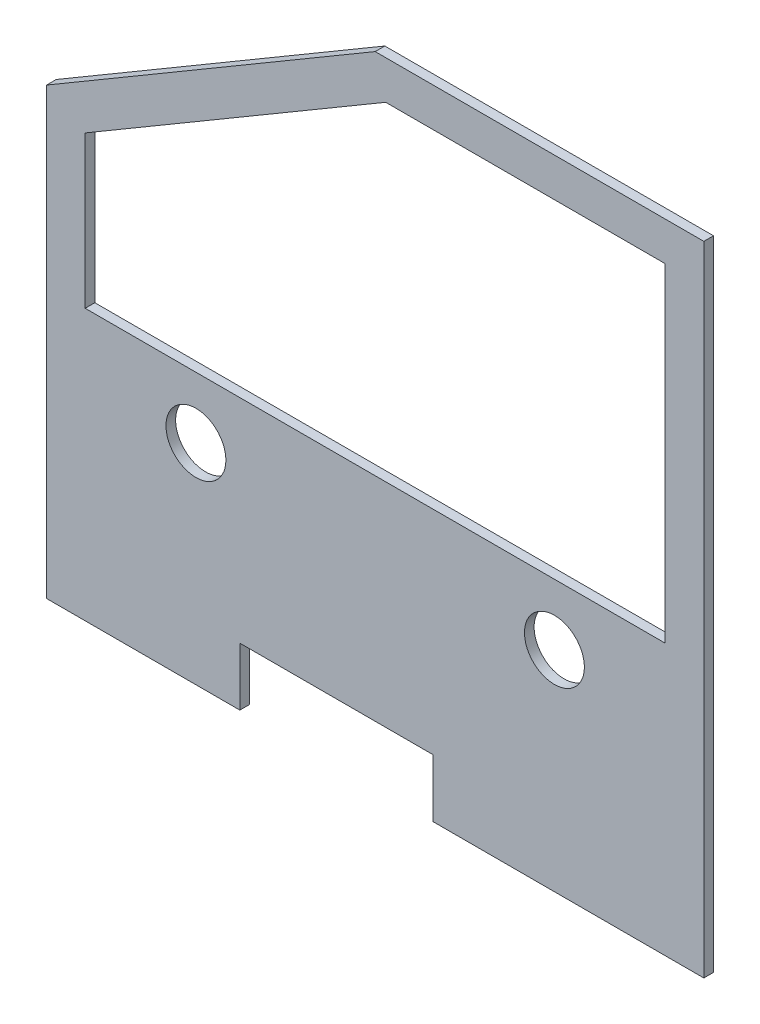
ISO-10303-21;
HEADER;
FILE_DESCRIPTION(('STEP AP214'),'2;1');
FILE_NAME('part.step','',(''),(''),'','','');
FILE_SCHEMA(('AUTOMOTIVE_DESIGN { 1 0 10303 214 1 1 1 1 }'));
ENDSEC;
DATA;
#1=APPLICATION_CONTEXT('core data for automotive mechanical design processes');
#2=APPLICATION_PROTOCOL_DEFINITION('international standard','automotive_design',2000,#1);
#3=PRODUCT_CONTEXT('',#1,'mechanical');
#4=PRODUCT('Part','Part','',(#3));
#5=PRODUCT_RELATED_PRODUCT_CATEGORY('part','',(#4));
#6=PRODUCT_DEFINITION_FORMATION('','',#4);
#7=PRODUCT_DEFINITION_CONTEXT('part definition',#1,'design');
#8=PRODUCT_DEFINITION('design','',#6,#7);
#9=PRODUCT_DEFINITION_SHAPE('','',#8);
#10=(LENGTH_UNIT() NAMED_UNIT(*) SI_UNIT(.MILLI.,.METRE.));
#11=(NAMED_UNIT(*) PLANE_ANGLE_UNIT() SI_UNIT($,.RADIAN.));
#12=(NAMED_UNIT(*) SI_UNIT($,.STERADIAN.) SOLID_ANGLE_UNIT());
#13=UNCERTAINTY_MEASURE_WITH_UNIT(LENGTH_MEASURE(1.E-05),#10,'distance_accuracy_value','');
#14=(GEOMETRIC_REPRESENTATION_CONTEXT(3) GLOBAL_UNCERTAINTY_ASSIGNED_CONTEXT((#13)) GLOBAL_UNIT_ASSIGNED_CONTEXT((#10,
#11,#12)) REPRESENTATION_CONTEXT('',''));
#15=CARTESIAN_POINT('',(0.,0.,0.));
#16=DIRECTION('',(0.,0.,1.));
#17=DIRECTION('',(1.,0.,0.));
#18=AXIS2_PLACEMENT_3D('',#15,#16,#17);
#19=CARTESIAN_POINT('',(431.8,12.7,6.35));
#20=DIRECTION('',(-1.,0.,0.));
#21=DIRECTION('',(0.,-1.,0.));
#22=AXIS2_PLACEMENT_3D('',#19,#20,#21);
#23=PLANE('',#22);
#24=DIRECTION('',(0.,1.,0.));
#25=VECTOR('',#24,1.);
#26=CARTESIAN_POINT('',(431.8,12.7,0.));
#27=LINE('',#26,#25);
#28=CARTESIAN_POINT('',(431.8,12.7,0.));
#29=VERTEX_POINT('',#28);
#30=CARTESIAN_POINT('',(431.8,431.8,0.));
#31=VERTEX_POINT('',#30);
#32=EDGE_CURVE('E187',#29,#31,#27,.T.);
#33=ORIENTED_EDGE('',*,*,#32,.T.);
#34=DIRECTION('',(0.,0.,-1.));
#35=VECTOR('',#34,1.);
#36=CARTESIAN_POINT('',(431.8,431.8,6.35));
#37=LINE('',#36,#35);
#38=CARTESIAN_POINT('',(431.8,431.8,6.35));
#39=VERTEX_POINT('',#38);
#40=EDGE_CURVE('E11',#39,#31,#37,.T.);
#41=ORIENTED_EDGE('',*,*,#40,.F.);
#42=DIRECTION('',(0.,1.,0.));
#43=VECTOR('',#42,1.);
#44=CARTESIAN_POINT('',(431.8,12.7,6.35));
#45=LINE('',#44,#43);
#46=CARTESIAN_POINT('',(431.8,12.7,6.35));
#47=VERTEX_POINT('',#46);
#48=EDGE_CURVE('E190',#47,#39,#45,.T.);
#49=ORIENTED_EDGE('',*,*,#48,.F.);
#50=DIRECTION('',(0.,0.,-1.));
#51=VECTOR('',#50,1.);
#52=CARTESIAN_POINT('',(431.8,12.7,6.35));
#53=LINE('',#52,#51);
#54=EDGE_CURVE('E210',#47,#29,#53,.T.);
#55=ORIENTED_EDGE('',*,*,#54,.T.);
#56=EDGE_LOOP('',(#33,#41,#49,#55));
#57=FACE_BOUND('',#56,.T.);
#58=ADVANCED_FACE('F33',(#57),#23,.F.);
#59=CARTESIAN_POINT('',(215.9,431.8,6.35));
#60=DIRECTION('',(0.,-1.,0.));
#61=DIRECTION('',(0.,0.,-1.));
#62=AXIS2_PLACEMENT_3D('',#59,#60,#61);
#63=PLANE('',#62);
#64=DIRECTION('',(-1.,0.,0.));
#65=VECTOR('',#64,1.);
#66=CARTESIAN_POINT('',(215.9,431.8,0.));
#67=LINE('',#66,#65);
#68=CARTESIAN_POINT('',(215.9,431.8,0.));
#69=VERTEX_POINT('',#68);
#70=EDGE_CURVE('E213',#31,#69,#67,.T.);
#71=ORIENTED_EDGE('',*,*,#70,.T.);
#72=DIRECTION('',(0.,0.,-1.));
#73=VECTOR('',#72,1.);
#74=CARTESIAN_POINT('',(215.9,431.8,6.35));
#75=LINE('',#74,#73);
#76=CARTESIAN_POINT('',(215.9,431.8,6.35));
#77=VERTEX_POINT('',#76);
#78=EDGE_CURVE('E40',#77,#69,#75,.T.);
#79=ORIENTED_EDGE('',*,*,#78,.F.);
#80=DIRECTION('',(-1.,0.,0.));
#81=VECTOR('',#80,1.);
#82=CARTESIAN_POINT('',(215.9,431.8,6.35));
#83=LINE('',#82,#81);
#84=EDGE_CURVE('E193',#39,#77,#83,.T.);
#85=ORIENTED_EDGE('',*,*,#84,.F.);
#86=ORIENTED_EDGE('',*,*,#40,.T.);
#87=EDGE_LOOP('',(#71,#79,#85,#86));
#88=FACE_BOUND('',#87,.T.);
#89=ADVANCED_FACE('F274',(#88),#63,.F.);
#90=CARTESIAN_POINT('',(0.,304.8,6.35));
#91=DIRECTION('',(0.507020126563394,-0.861934215157769,0.));
#92=DIRECTION('',(0.86193421515777,0.507020126563394,0.));
#93=AXIS2_PLACEMENT_3D('',#90,#91,#92);
#94=PLANE('',#93);
#95=DIRECTION('',(-0.861934215157769,-0.507020126563394,0.));
#96=VECTOR('',#95,1.);
#97=CARTESIAN_POINT('',(0.,304.8,0.));
#98=LINE('',#97,#96);
#99=CARTESIAN_POINT('',(0.,304.8,0.));
#100=VERTEX_POINT('',#99);
#101=EDGE_CURVE('E215',#69,#100,#98,.T.);
#102=ORIENTED_EDGE('',*,*,#101,.T.);
#103=DIRECTION('',(0.,0.,-1.));
#104=VECTOR('',#103,1.);
#105=CARTESIAN_POINT('',(0.,304.8,6.35));
#106=LINE('',#105,#104);
#107=CARTESIAN_POINT('',(0.,304.8,6.35));
#108=VERTEX_POINT('',#107);
#109=EDGE_CURVE('E245',#108,#100,#106,.T.);
#110=ORIENTED_EDGE('',*,*,#109,.F.);
#111=DIRECTION('',(-0.861934215157769,-0.507020126563394,0.));
#112=VECTOR('',#111,1.);
#113=CARTESIAN_POINT('',(0.,304.8,6.35));
#114=LINE('',#113,#112);
#115=EDGE_CURVE('E196',#77,#108,#114,.T.);
#116=ORIENTED_EDGE('',*,*,#115,.F.);
#117=ORIENTED_EDGE('',*,*,#78,.T.);
#118=EDGE_LOOP('',(#102,#110,#116,#117));
#119=FACE_BOUND('',#118,.T.);
#120=ADVANCED_FACE('F252',(#119),#94,.F.);
#121=CARTESIAN_POINT('',(0.,304.8,6.35));
#122=DIRECTION('',(1.,0.,0.));
#123=DIRECTION('',(0.,1.,0.));
#124=AXIS2_PLACEMENT_3D('',#121,#122,#123);
#125=PLANE('',#124);
#126=DIRECTION('',(0.,-1.,0.));
#127=VECTOR('',#126,1.);
#128=CARTESIAN_POINT('',(0.,304.8,0.));
#129=LINE('',#128,#127);
#130=CARTESIAN_POINT('',(0.,12.7,0.));
#131=VERTEX_POINT('',#130);
#132=EDGE_CURVE('E217',#100,#131,#129,.T.);
#133=ORIENTED_EDGE('',*,*,#132,.T.);
#134=DIRECTION('',(0.,0.,-1.));
#135=VECTOR('',#134,1.);
#136=CARTESIAN_POINT('',(0.,12.7,6.35));
#137=LINE('',#136,#135);
#138=CARTESIAN_POINT('',(0.,12.7,6.35));
#139=VERTEX_POINT('',#138);
#140=EDGE_CURVE('E242',#139,#131,#137,.T.);
#141=ORIENTED_EDGE('',*,*,#140,.F.);
#142=DIRECTION('',(0.,-1.,0.));
#143=VECTOR('',#142,1.);
#144=CARTESIAN_POINT('',(0.,304.8,6.35));
#145=LINE('',#144,#143);
#146=EDGE_CURVE('E198',#108,#139,#145,.T.);
#147=ORIENTED_EDGE('',*,*,#146,.F.);
#148=ORIENTED_EDGE('',*,*,#109,.T.);
#149=EDGE_LOOP('',(#133,#141,#147,#148));
#150=FACE_BOUND('',#149,.T.);
#151=ADVANCED_FACE('F263',(#150),#125,.F.);
#152=CARTESIAN_POINT('',(0.,12.7,6.35));
#153=DIRECTION('',(0.,1.,0.));
#154=DIRECTION('',(-1.,0.,0.));
#155=AXIS2_PLACEMENT_3D('',#152,#153,#154);
#156=PLANE('',#155);
#157=DIRECTION('',(1.,0.,0.));
#158=VECTOR('',#157,1.);
#159=CARTESIAN_POINT('',(0.,12.7,0.));
#160=LINE('',#159,#158);
#161=CARTESIAN_POINT('',(127.,12.7,0.));
#162=VERTEX_POINT('',#161);
#163=EDGE_CURVE('E219',#131,#162,#160,.T.);
#164=ORIENTED_EDGE('',*,*,#163,.T.);
#165=DIRECTION('',(0.,0.,-1.));
#166=VECTOR('',#165,1.);
#167=CARTESIAN_POINT('',(127.,12.7,6.35));
#168=LINE('',#167,#166);
#169=CARTESIAN_POINT('',(127.,12.7,6.35));
#170=VERTEX_POINT('',#169);
#171=EDGE_CURVE('E239',#170,#162,#168,.T.);
#172=ORIENTED_EDGE('',*,*,#171,.F.);
#173=DIRECTION('',(1.,0.,0.));
#174=VECTOR('',#173,1.);
#175=CARTESIAN_POINT('',(0.,12.7,6.35));
#176=LINE('',#175,#174);
#177=EDGE_CURVE('E200',#139,#170,#176,.T.);
#178=ORIENTED_EDGE('',*,*,#177,.F.);
#179=ORIENTED_EDGE('',*,*,#140,.T.);
#180=EDGE_LOOP('',(#164,#172,#178,#179));
#181=FACE_BOUND('',#180,.T.);
#182=ADVANCED_FACE('F267',(#181),#156,.F.);
#183=CARTESIAN_POINT('',(127.,12.7,6.35));
#184=DIRECTION('',(-1.,0.,0.));
#185=DIRECTION('',(0.,0.,1.));
#186=AXIS2_PLACEMENT_3D('',#183,#184,#185);
#187=PLANE('',#186);
#188=DIRECTION('',(0.,1.,0.));
#189=VECTOR('',#188,1.);
#190=CARTESIAN_POINT('',(127.,12.7,0.));
#191=LINE('',#190,#189);
#192=CARTESIAN_POINT('',(127.,50.8,0.));
#193=VERTEX_POINT('',#192);
#194=EDGE_CURVE('E221',#162,#193,#191,.T.);
#195=ORIENTED_EDGE('',*,*,#194,.T.);
#196=DIRECTION('',(0.,0.,-1.));
#197=VECTOR('',#196,1.);
#198=CARTESIAN_POINT('',(127.,50.8,6.35));
#199=LINE('',#198,#197);
#200=CARTESIAN_POINT('',(127.,50.8,6.35));
#201=VERTEX_POINT('',#200);
#202=EDGE_CURVE('E236',#201,#193,#199,.T.);
#203=ORIENTED_EDGE('',*,*,#202,.F.);
#204=DIRECTION('',(0.,1.,0.));
#205=VECTOR('',#204,1.);
#206=CARTESIAN_POINT('',(127.,12.7,6.35));
#207=LINE('',#206,#205);
#208=EDGE_CURVE('E202',#170,#201,#207,.T.);
#209=ORIENTED_EDGE('',*,*,#208,.F.);
#210=ORIENTED_EDGE('',*,*,#171,.T.);
#211=EDGE_LOOP('',(#195,#203,#209,#210));
#212=FACE_BOUND('',#211,.T.);
#213=ADVANCED_FACE('F292',(#212),#187,.F.);
#214=CARTESIAN_POINT('',(254.,50.8,6.35));
#215=DIRECTION('',(0.,1.,0.));
#216=DIRECTION('',(-1.,0.,0.));
#217=AXIS2_PLACEMENT_3D('',#214,#215,#216);
#218=PLANE('',#217);
#219=DIRECTION('',(1.,0.,0.));
#220=VECTOR('',#219,1.);
#221=CARTESIAN_POINT('',(254.,50.8,0.));
#222=LINE('',#221,#220);
#223=CARTESIAN_POINT('',(254.,50.8,0.));
#224=VERTEX_POINT('',#223);
#225=EDGE_CURVE('E223',#193,#224,#222,.T.);
#226=ORIENTED_EDGE('',*,*,#225,.T.);
#227=DIRECTION('',(0.,0.,-1.));
#228=VECTOR('',#227,1.);
#229=CARTESIAN_POINT('',(254.,50.8,6.35));
#230=LINE('',#229,#228);
#231=CARTESIAN_POINT('',(254.,50.8,6.35));
#232=VERTEX_POINT('',#231);
#233=EDGE_CURVE('E233',#232,#224,#230,.T.);
#234=ORIENTED_EDGE('',*,*,#233,.F.);
#235=DIRECTION('',(1.,0.,0.));
#236=VECTOR('',#235,1.);
#237=CARTESIAN_POINT('',(254.,50.8,6.35));
#238=LINE('',#237,#236);
#239=EDGE_CURVE('E204',#201,#232,#238,.T.);
#240=ORIENTED_EDGE('',*,*,#239,.F.);
#241=ORIENTED_EDGE('',*,*,#202,.T.);
#242=EDGE_LOOP('',(#226,#234,#240,#241));
#243=FACE_BOUND('',#242,.T.);
#244=ADVANCED_FACE('F290',(#243),#218,.F.);
#245=CARTESIAN_POINT('',(254.,50.8,6.35));
#246=DIRECTION('',(1.,0.,0.));
#247=DIRECTION('',(0.,1.,0.));
#248=AXIS2_PLACEMENT_3D('',#245,#246,#247);
#249=PLANE('',#248);
#250=DIRECTION('',(0.,-1.,0.));
#251=VECTOR('',#250,1.);
#252=CARTESIAN_POINT('',(254.,50.8,0.));
#253=LINE('',#252,#251);
#254=CARTESIAN_POINT('',(254.,12.7,0.));
#255=VERTEX_POINT('',#254);
#256=EDGE_CURVE('E225',#224,#255,#253,.T.);
#257=ORIENTED_EDGE('',*,*,#256,.T.);
#258=DIRECTION('',(0.,0.,-1.));
#259=VECTOR('',#258,1.);
#260=CARTESIAN_POINT('',(254.,12.7,6.35));
#261=LINE('',#260,#259);
#262=CARTESIAN_POINT('',(254.,12.7,6.35));
#263=VERTEX_POINT('',#262);
#264=EDGE_CURVE('E230',#263,#255,#261,.T.);
#265=ORIENTED_EDGE('',*,*,#264,.F.);
#266=DIRECTION('',(0.,-1.,0.));
#267=VECTOR('',#266,1.);
#268=CARTESIAN_POINT('',(254.,50.8,6.35));
#269=LINE('',#268,#267);
#270=EDGE_CURVE('E206',#232,#263,#269,.T.);
#271=ORIENTED_EDGE('',*,*,#270,.F.);
#272=ORIENTED_EDGE('',*,*,#233,.T.);
#273=EDGE_LOOP('',(#257,#265,#271,#272));
#274=FACE_BOUND('',#273,.T.);
#275=ADVANCED_FACE('F286',(#274),#249,.F.);
#276=CARTESIAN_POINT('',(254.,12.7,6.35));
#277=DIRECTION('',(0.,1.,0.));
#278=DIRECTION('',(-1.,0.,0.));
#279=AXIS2_PLACEMENT_3D('',#276,#277,#278);
#280=PLANE('',#279);
#281=DIRECTION('',(1.,0.,0.));
#282=VECTOR('',#281,1.);
#283=CARTESIAN_POINT('',(254.,12.7,0.));
#284=LINE('',#283,#282);
#285=EDGE_CURVE('E194',#255,#29,#284,.T.);
#286=ORIENTED_EDGE('',*,*,#285,.T.);
#287=ORIENTED_EDGE('',*,*,#54,.F.);
#288=DIRECTION('',(1.,0.,0.));
#289=VECTOR('',#288,1.);
#290=CARTESIAN_POINT('',(254.,12.7,6.35));
#291=LINE('',#290,#289);
#292=EDGE_CURVE('E208',#263,#47,#291,.T.);
#293=ORIENTED_EDGE('',*,*,#292,.F.);
#294=ORIENTED_EDGE('',*,*,#264,.T.);
#295=EDGE_LOOP('',(#286,#287,#293,#294));
#296=FACE_BOUND('',#295,.T.);
#297=ADVANCED_FACE('F281',(#296),#280,.F.);
#298=CARTESIAN_POINT('',(0.,0.,6.35));
#299=DIRECTION('',(0.,0.,-1.));
#300=DIRECTION('',(-1.,0.,0.));
#301=AXIS2_PLACEMENT_3D('',#298,#299,#300);
#302=PLANE('',#301);
#303=DIRECTION('',(0.86193421515777,0.507020126563394,0.));
#304=VECTOR('',#303,1.);
#305=CARTESIAN_POINT('',(25.4,290.272570220457,6.35));
#306=LINE('',#305,#304);
#307=CARTESIAN_POINT('',(25.4,290.272570220457,6.35));
#308=VERTEX_POINT('',#307);
#309=CARTESIAN_POINT('',(222.816630625223,406.4,6.35));
#310=VERTEX_POINT('',#309);
#311=EDGE_CURVE('E141',#308,#310,#306,.T.);
#312=ORIENTED_EDGE('',*,*,#311,.T.);
#313=DIRECTION('',(1.,0.,0.));
#314=VECTOR('',#313,1.);
#315=CARTESIAN_POINT('',(222.816630625223,406.4,6.35));
#316=LINE('',#315,#314);
#317=CARTESIAN_POINT('',(406.4,406.4,6.35));
#318=VERTEX_POINT('',#317);
#319=EDGE_CURVE('E135',#310,#318,#316,.T.);
#320=ORIENTED_EDGE('',*,*,#319,.T.);
#321=DIRECTION('',(0.,-1.,0.));
#322=VECTOR('',#321,1.);
#323=CARTESIAN_POINT('',(406.4,406.4,6.35));
#324=LINE('',#323,#322);
#325=CARTESIAN_POINT('',(406.4,190.5,6.35));
#326=VERTEX_POINT('',#325);
#327=EDGE_CURVE('E144',#318,#326,#324,.T.);
#328=ORIENTED_EDGE('',*,*,#327,.T.);
#329=DIRECTION('',(-1.,0.,0.));
#330=VECTOR('',#329,1.);
#331=CARTESIAN_POINT('',(406.4,190.5,6.35));
#332=LINE('',#331,#330);
#333=CARTESIAN_POINT('',(25.4,190.5,6.35));
#334=VERTEX_POINT('',#333);
#335=EDGE_CURVE('E47',#326,#334,#332,.T.);
#336=ORIENTED_EDGE('',*,*,#335,.T.);
#337=DIRECTION('',(0.,1.,0.));
#338=VECTOR('',#337,1.);
#339=CARTESIAN_POINT('',(25.4,190.5,6.35));
#340=LINE('',#339,#338);
#341=EDGE_CURVE('E159',#334,#308,#340,.T.);
#342=ORIENTED_EDGE('',*,*,#341,.T.);
#343=EDGE_LOOP('',(#312,#320,#328,#336,#342));
#344=FACE_BOUND('',#343,.T.);
#345=CARTESIAN_POINT('',(333.65,150.3,6.35));
#346=DIRECTION('',(0.,0.,1.));
#347=DIRECTION('',(1.,0.,0.));
#348=AXIS2_PLACEMENT_3D('',#345,#346,#347);
#349=CIRCLE('',#348,19.685);
#350=CARTESIAN_POINT('',(353.335,150.3,6.35));
#351=VERTEX_POINT('',#350);
#352=EDGE_CURVE('E172',#351,#351,#349,.T.);
#353=ORIENTED_EDGE('',*,*,#352,.F.);
#354=EDGE_LOOP('',(#353));
#355=FACE_BOUND('',#354,.T.);
#356=CARTESIAN_POINT('',(98.15,150.3,6.35));
#357=DIRECTION('',(0.,0.,1.));
#358=DIRECTION('',(1.,0.,0.));
#359=AXIS2_PLACEMENT_3D('',#356,#357,#358);
#360=CIRCLE('',#359,19.685);
#361=CARTESIAN_POINT('',(117.835,150.3,6.35));
#362=VERTEX_POINT('',#361);
#363=EDGE_CURVE('E181',#362,#362,#360,.T.);
#364=ORIENTED_EDGE('',*,*,#363,.F.);
#365=EDGE_LOOP('',(#364));
#366=FACE_BOUND('',#365,.T.);
#367=ORIENTED_EDGE('',*,*,#48,.T.);
#368=ORIENTED_EDGE('',*,*,#84,.T.);
#369=ORIENTED_EDGE('',*,*,#115,.T.);
#370=ORIENTED_EDGE('',*,*,#146,.T.);
#371=ORIENTED_EDGE('',*,*,#177,.T.);
#372=ORIENTED_EDGE('',*,*,#208,.T.);
#373=ORIENTED_EDGE('',*,*,#239,.T.);
#374=ORIENTED_EDGE('',*,*,#270,.T.);
#375=ORIENTED_EDGE('',*,*,#292,.T.);
#376=EDGE_LOOP('',(#367,#368,#369,#370,#371,#372,#373,#374,#375));
#377=FACE_BOUND('',#376,.T.);
#378=ADVANCED_FACE('F148',(#344,#355,#366,#377),#302,.F.);
#379=CARTESIAN_POINT('',(0.,0.,0.));
#380=DIRECTION('',(0.,0.,-1.));
#381=DIRECTION('',(-1.,0.,0.));
#382=AXIS2_PLACEMENT_3D('',#379,#380,#381);
#383=PLANE('',#382);
#384=DIRECTION('',(1.,0.,0.));
#385=VECTOR('',#384,1.);
#386=CARTESIAN_POINT('',(222.816630625223,406.4,0.));
#387=LINE('',#386,#385);
#388=CARTESIAN_POINT('',(222.816630625223,406.4,0.));
#389=VERTEX_POINT('',#388);
#390=CARTESIAN_POINT('',(406.4,406.4,0.));
#391=VERTEX_POINT('',#390);
#392=EDGE_CURVE('E55',#389,#391,#387,.T.);
#393=ORIENTED_EDGE('',*,*,#392,.F.);
#394=DIRECTION('',(0.86193421515777,0.507020126563394,0.));
#395=VECTOR('',#394,1.);
#396=CARTESIAN_POINT('',(25.4,290.272570220457,0.));
#397=LINE('',#396,#395);
#398=CARTESIAN_POINT('',(25.4,290.272570220457,0.));
#399=VERTEX_POINT('',#398);
#400=EDGE_CURVE('E152',#399,#389,#397,.T.);
#401=ORIENTED_EDGE('',*,*,#400,.F.);
#402=DIRECTION('',(0.,1.,0.));
#403=VECTOR('',#402,1.);
#404=CARTESIAN_POINT('',(25.4,190.5,0.));
#405=LINE('',#404,#403);
#406=CARTESIAN_POINT('',(25.4,190.5,0.));
#407=VERTEX_POINT('',#406);
#408=EDGE_CURVE('E155',#407,#399,#405,.T.);
#409=ORIENTED_EDGE('',*,*,#408,.F.);
#410=DIRECTION('',(-1.,0.,0.));
#411=VECTOR('',#410,1.);
#412=CARTESIAN_POINT('',(406.4,190.5,0.));
#413=LINE('',#412,#411);
#414=CARTESIAN_POINT('',(406.4,190.5,0.));
#415=VERTEX_POINT('',#414);
#416=EDGE_CURVE('E165',#415,#407,#413,.T.);
#417=ORIENTED_EDGE('',*,*,#416,.F.);
#418=DIRECTION('',(0.,-1.,0.));
#419=VECTOR('',#418,1.);
#420=CARTESIAN_POINT('',(406.4,406.4,0.));
#421=LINE('',#420,#419);
#422=EDGE_CURVE('E163',#391,#415,#421,.T.);
#423=ORIENTED_EDGE('',*,*,#422,.F.);
#424=EDGE_LOOP('',(#393,#401,#409,#417,#423));
#425=FACE_BOUND('',#424,.T.);
#426=CARTESIAN_POINT('',(333.65,150.3,0.));
#427=DIRECTION('',(0.,0.,1.));
#428=DIRECTION('',(1.,0.,0.));
#429=AXIS2_PLACEMENT_3D('',#426,#427,#428);
#430=CIRCLE('',#429,19.685);
#431=CARTESIAN_POINT('',(353.335,150.3,0.));
#432=VERTEX_POINT('',#431);
#433=EDGE_CURVE('E178',#432,#432,#430,.T.);
#434=ORIENTED_EDGE('',*,*,#433,.T.);
#435=EDGE_LOOP('',(#434));
#436=FACE_BOUND('',#435,.T.);
#437=CARTESIAN_POINT('',(98.15,150.3,0.));
#438=DIRECTION('',(0.,0.,1.));
#439=DIRECTION('',(1.,0.,0.));
#440=AXIS2_PLACEMENT_3D('',#437,#438,#439);
#441=CIRCLE('',#440,19.685);
#442=CARTESIAN_POINT('',(117.835,150.3,0.));
#443=VERTEX_POINT('',#442);
#444=EDGE_CURVE('E184',#443,#443,#441,.T.);
#445=ORIENTED_EDGE('',*,*,#444,.T.);
#446=EDGE_LOOP('',(#445));
#447=FACE_BOUND('',#446,.T.);
#448=ORIENTED_EDGE('',*,*,#32,.F.);
#449=ORIENTED_EDGE('',*,*,#285,.F.);
#450=ORIENTED_EDGE('',*,*,#256,.F.);
#451=ORIENTED_EDGE('',*,*,#225,.F.);
#452=ORIENTED_EDGE('',*,*,#194,.F.);
#453=ORIENTED_EDGE('',*,*,#163,.F.);
#454=ORIENTED_EDGE('',*,*,#132,.F.);
#455=ORIENTED_EDGE('',*,*,#101,.F.);
#456=ORIENTED_EDGE('',*,*,#70,.F.);
#457=EDGE_LOOP('',(#448,#449,#450,#451,#452,#453,#454,#455,#456));
#458=FACE_BOUND('',#457,.T.);
#459=ADVANCED_FACE('F258',(#425,#436,#447,#458),#383,.T.);
#460=CARTESIAN_POINT('',(98.15,150.3,0.));
#461=DIRECTION('',(0.,0.,1.));
#462=DIRECTION('',(1.,0.,0.));
#463=AXIS2_PLACEMENT_3D('',#460,#461,#462);
#464=CYLINDRICAL_SURFACE('',#463,19.685);
#465=ORIENTED_EDGE('',*,*,#444,.F.);
#466=EDGE_LOOP('',(#465));
#467=FACE_BOUND('',#466,.T.);
#468=ORIENTED_EDGE('',*,*,#363,.T.);
#469=EDGE_LOOP('',(#468));
#470=FACE_BOUND('',#469,.T.);
#471=ADVANCED_FACE('F365',(#467,#470),#464,.F.);
#472=CARTESIAN_POINT('',(333.65,150.3,0.));
#473=DIRECTION('',(0.,0.,1.));
#474=DIRECTION('',(1.,0.,0.));
#475=AXIS2_PLACEMENT_3D('',#472,#473,#474);
#476=CYLINDRICAL_SURFACE('',#475,19.685);
#477=ORIENTED_EDGE('',*,*,#433,.F.);
#478=EDGE_LOOP('',(#477));
#479=FACE_BOUND('',#478,.T.);
#480=ORIENTED_EDGE('',*,*,#352,.T.);
#481=EDGE_LOOP('',(#480));
#482=FACE_BOUND('',#481,.T.);
#483=ADVANCED_FACE('F375',(#479,#482),#476,.F.);
#484=CARTESIAN_POINT('',(222.816630625223,406.4,6.35));
#485=DIRECTION('',(0.,1.,0.));
#486=DIRECTION('',(0.,0.,1.));
#487=AXIS2_PLACEMENT_3D('',#484,#485,#486);
#488=PLANE('',#487);
#489=ORIENTED_EDGE('',*,*,#392,.T.);
#490=DIRECTION('',(0.,0.,-1.));
#491=VECTOR('',#490,1.);
#492=CARTESIAN_POINT('',(406.4,406.4,6.35));
#493=LINE('',#492,#491);
#494=EDGE_CURVE('E131',#318,#391,#493,.T.);
#495=ORIENTED_EDGE('',*,*,#494,.F.);
#496=ORIENTED_EDGE('',*,*,#319,.F.);
#497=DIRECTION('',(0.,0.,-1.));
#498=VECTOR('',#497,1.);
#499=CARTESIAN_POINT('',(222.816630625223,406.4,6.35));
#500=LINE('',#499,#498);
#501=EDGE_CURVE('E170',#310,#389,#500,.T.);
#502=ORIENTED_EDGE('',*,*,#501,.T.);
#503=EDGE_LOOP('',(#489,#495,#496,#502));
#504=FACE_BOUND('',#503,.T.);
#505=ADVANCED_FACE('F133',(#504),#488,.F.);
#506=CARTESIAN_POINT('',(25.4,290.272570220457,6.35));
#507=DIRECTION('',(-0.507020126563394,0.86193421515777,0.));
#508=DIRECTION('',(-0.86193421515777,-0.507020126563394,0.));
#509=AXIS2_PLACEMENT_3D('',#506,#507,#508);
#510=PLANE('',#509);
#511=ORIENTED_EDGE('',*,*,#400,.T.);
#512=ORIENTED_EDGE('',*,*,#501,.F.);
#513=ORIENTED_EDGE('',*,*,#311,.F.);
#514=DIRECTION('',(0.,0.,-1.));
#515=VECTOR('',#514,1.);
#516=CARTESIAN_POINT('',(25.4,290.272570220457,6.35));
#517=LINE('',#516,#515);
#518=EDGE_CURVE('E173',#308,#399,#517,.T.);
#519=ORIENTED_EDGE('',*,*,#518,.T.);
#520=EDGE_LOOP('',(#511,#512,#513,#519));
#521=FACE_BOUND('',#520,.T.);
#522=ADVANCED_FACE('F394',(#521),#510,.F.);
#523=CARTESIAN_POINT('',(25.4,190.5,6.35));
#524=DIRECTION('',(-1.,0.,0.));
#525=DIRECTION('',(0.,-1.,0.));
#526=AXIS2_PLACEMENT_3D('',#523,#524,#525);
#527=PLANE('',#526);
#528=ORIENTED_EDGE('',*,*,#408,.T.);
#529=ORIENTED_EDGE('',*,*,#518,.F.);
#530=ORIENTED_EDGE('',*,*,#341,.F.);
#531=DIRECTION('',(0.,0.,-1.));
#532=VECTOR('',#531,1.);
#533=CARTESIAN_POINT('',(25.4,190.5,6.35));
#534=LINE('',#533,#532);
#535=EDGE_CURVE('E175',#334,#407,#534,.T.);
#536=ORIENTED_EDGE('',*,*,#535,.T.);
#537=EDGE_LOOP('',(#528,#529,#530,#536));
#538=FACE_BOUND('',#537,.T.);
#539=ADVANCED_FACE('F402',(#538),#527,.F.);
#540=CARTESIAN_POINT('',(406.4,190.5,6.35));
#541=DIRECTION('',(0.,-1.,0.));
#542=DIRECTION('',(0.,0.,-1.));
#543=AXIS2_PLACEMENT_3D('',#540,#541,#542);
#544=PLANE('',#543);
#545=ORIENTED_EDGE('',*,*,#416,.T.);
#546=ORIENTED_EDGE('',*,*,#535,.F.);
#547=ORIENTED_EDGE('',*,*,#335,.F.);
#548=DIRECTION('',(0.,0.,-1.));
#549=VECTOR('',#548,1.);
#550=CARTESIAN_POINT('',(406.4,190.5,6.35));
#551=LINE('',#550,#549);
#552=EDGE_CURVE('E140',#326,#415,#551,.T.);
#553=ORIENTED_EDGE('',*,*,#552,.T.);
#554=EDGE_LOOP('',(#545,#546,#547,#553));
#555=FACE_BOUND('',#554,.T.);
#556=ADVANCED_FACE('F411',(#555),#544,.F.);
#557=CARTESIAN_POINT('',(406.4,406.4,6.35));
#558=DIRECTION('',(1.,0.,0.));
#559=DIRECTION('',(0.,0.,-1.));
#560=AXIS2_PLACEMENT_3D('',#557,#558,#559);
#561=PLANE('',#560);
#562=ORIENTED_EDGE('',*,*,#422,.T.);
#563=ORIENTED_EDGE('',*,*,#552,.F.);
#564=ORIENTED_EDGE('',*,*,#327,.F.);
#565=ORIENTED_EDGE('',*,*,#494,.T.);
#566=EDGE_LOOP('',(#562,#563,#564,#565));
#567=FACE_BOUND('',#566,.T.);
#568=ADVANCED_FACE('F145',(#567),#561,.F.);
#569=CLOSED_SHELL('',(#58,#89,#120,#151,#182,#213,#244,#275,#297,#378,#459,#471,#483,#505,#522,
#539,#556,#568));
#570=MANIFOLD_SOLID_BREP('B2',#569);
#571=ADVANCED_BREP_SHAPE_REPRESENTATION('',(#18,#570),#14);
#572=SHAPE_DEFINITION_REPRESENTATION(#9,#571);
ENDSEC;
END-ISO-10303-21;
